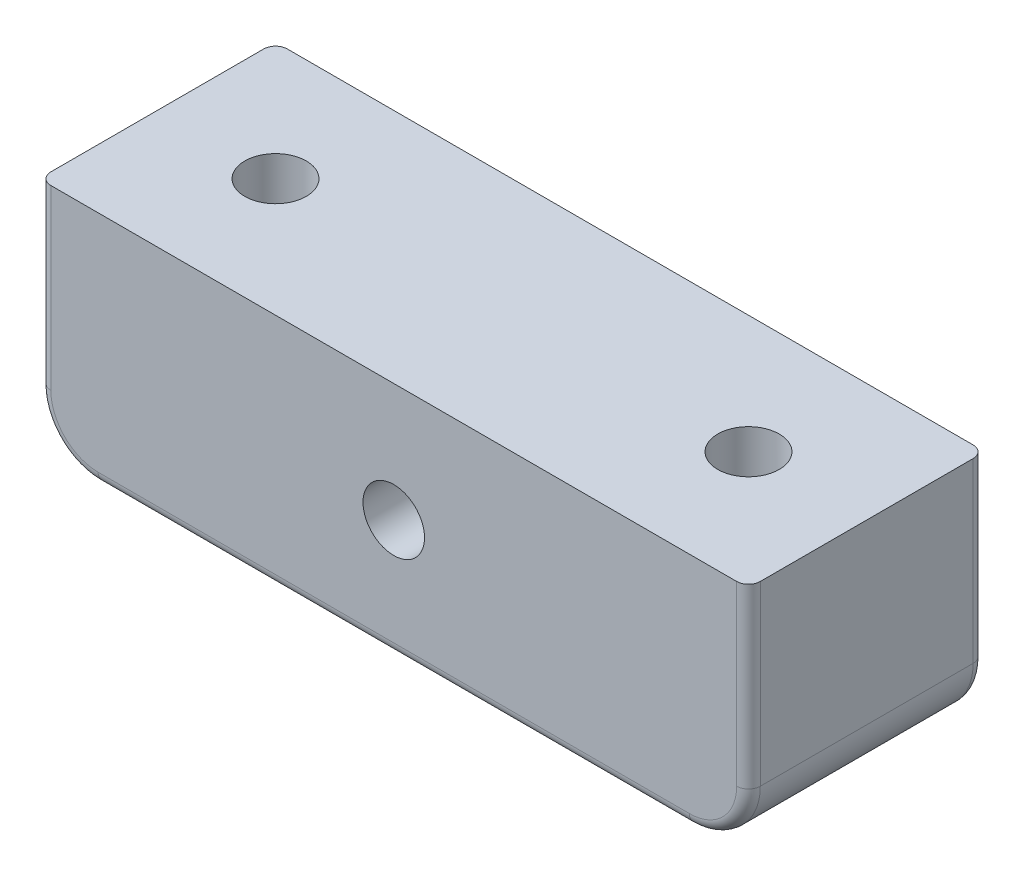
ISO-10303-21;
HEADER;
FILE_DESCRIPTION(('STEP AP214'),'2;1');
FILE_NAME('part.step','',(''),(''),'','','');
FILE_SCHEMA(('AUTOMOTIVE_DESIGN { 1 0 10303 214 1 1 1 1 }'));
ENDSEC;
DATA;
#1=APPLICATION_CONTEXT('core data for automotive mechanical design processes');
#2=APPLICATION_PROTOCOL_DEFINITION('international standard','automotive_design',2000,#1);
#3=PRODUCT_CONTEXT('',#1,'mechanical');
#4=PRODUCT('Part','Part','',(#3));
#5=PRODUCT_RELATED_PRODUCT_CATEGORY('part','',(#4));
#6=PRODUCT_DEFINITION_FORMATION('','',#4);
#7=PRODUCT_DEFINITION_CONTEXT('part definition',#1,'design');
#8=PRODUCT_DEFINITION('design','',#6,#7);
#9=PRODUCT_DEFINITION_SHAPE('','',#8);
#10=(LENGTH_UNIT() NAMED_UNIT(*) SI_UNIT(.MILLI.,.METRE.));
#11=(NAMED_UNIT(*) PLANE_ANGLE_UNIT() SI_UNIT($,.RADIAN.));
#12=(NAMED_UNIT(*) SI_UNIT($,.STERADIAN.) SOLID_ANGLE_UNIT());
#13=UNCERTAINTY_MEASURE_WITH_UNIT(LENGTH_MEASURE(1.E-05),#10,'distance_accuracy_value','');
#14=(GEOMETRIC_REPRESENTATION_CONTEXT(3) GLOBAL_UNCERTAINTY_ASSIGNED_CONTEXT((#13)) GLOBAL_UNIT_ASSIGNED_CONTEXT((#10,
#11,#12)) REPRESENTATION_CONTEXT('',''));
#15=CARTESIAN_POINT('',(0.,0.,0.));
#16=DIRECTION('',(0.,0.,1.));
#17=DIRECTION('',(1.,0.,0.));
#18=AXIS2_PLACEMENT_3D('',#15,#16,#17);
#19=CARTESIAN_POINT('',(0.,-10.,20.));
#20=DIRECTION('',(0.,0.,-1.));
#21=DIRECTION('',(-1.,0.,0.));
#22=AXIS2_PLACEMENT_3D('',#19,#20,#21);
#23=CYLINDRICAL_SURFACE('',#22,2.6);
#24=CARTESIAN_POINT('',(0.,-10.,20.));
#25=DIRECTION('',(0.,0.,1.));
#26=DIRECTION('',(1.,0.,0.));
#27=AXIS2_PLACEMENT_3D('',#24,#25,#26);
#28=CIRCLE('',#27,2.6);
#29=CARTESIAN_POINT('',(2.6,-10.,20.));
#30=VERTEX_POINT('',#29);
#31=EDGE_CURVE('E233',#30,#30,#28,.T.);
#32=ORIENTED_EDGE('',*,*,#31,.T.);
#33=EDGE_LOOP('',(#32));
#34=FACE_BOUND('',#33,.T.);
#35=CARTESIAN_POINT('',(0.,-10.,3.));
#36=DIRECTION('',(0.,0.,-1.));
#37=DIRECTION('',(-1.,0.,0.));
#38=AXIS2_PLACEMENT_3D('',#35,#36,#37);
#39=CIRCLE('',#38,2.6);
#40=CARTESIAN_POINT('',(-2.6,-10.,3.));
#41=VERTEX_POINT('',#40);
#42=EDGE_CURVE('E213',#41,#41,#39,.T.);
#43=ORIENTED_EDGE('',*,*,#42,.T.);
#44=EDGE_LOOP('',(#43));
#45=FACE_BOUND('',#44,.T.);
#46=ADVANCED_FACE('F33',(#34,#45),#23,.F.);
#47=CARTESIAN_POINT('',(-25.,-15.,20.));
#48=DIRECTION('',(0.,0.,-1.));
#49=DIRECTION('',(-1.,0.,0.));
#50=AXIS2_PLACEMENT_3D('',#47,#48,#49);
#51=PLANE('',#50);
#52=DIRECTION('',(-1.,0.,0.));
#53=VECTOR('',#52,1.);
#54=CARTESIAN_POINT('',(-30.,0.,20.));
#55=LINE('',#54,#53);
#56=CARTESIAN_POINT('',(29.,0.,20.));
#57=VERTEX_POINT('',#56);
#58=CARTESIAN_POINT('',(-29.,0.,20.));
#59=VERTEX_POINT('',#58);
#60=EDGE_CURVE('E237',#57,#59,#55,.T.);
#61=ORIENTED_EDGE('',*,*,#60,.T.);
#62=DIRECTION('',(0.,-1.,0.));
#63=VECTOR('',#62,1.);
#64=CARTESIAN_POINT('',(-29.,-15.,20.));
#65=LINE('',#64,#63);
#66=CARTESIAN_POINT('',(-29.,-15.,20.));
#67=VERTEX_POINT('',#66);
#68=EDGE_CURVE('E304',#59,#67,#65,.T.);
#69=ORIENTED_EDGE('',*,*,#68,.T.);
#70=CARTESIAN_POINT('',(-25.,-15.,20.));
#71=DIRECTION('',(0.,0.,-1.));
#72=DIRECTION('',(-1.,0.,0.));
#73=AXIS2_PLACEMENT_3D('',#70,#71,#72);
#74=CIRCLE('',#73,4.);
#75=CARTESIAN_POINT('',(-25.,-19.,20.));
#76=VERTEX_POINT('',#75);
#77=EDGE_CURVE('E57',#67,#76,#74,.F.);
#78=ORIENTED_EDGE('',*,*,#77,.T.);
#79=DIRECTION('',(1.,0.,0.));
#80=VECTOR('',#79,1.);
#81=CARTESIAN_POINT('',(-25.,-19.,20.));
#82=LINE('',#81,#80);
#83=CARTESIAN_POINT('',(25.,-19.,20.));
#84=VERTEX_POINT('',#83);
#85=EDGE_CURVE('E301',#76,#84,#82,.T.);
#86=ORIENTED_EDGE('',*,*,#85,.T.);
#87=CARTESIAN_POINT('',(25.,-15.,20.));
#88=DIRECTION('',(0.,0.,-1.));
#89=DIRECTION('',(-1.,0.,0.));
#90=AXIS2_PLACEMENT_3D('',#87,#88,#89);
#91=CIRCLE('',#90,4.);
#92=CARTESIAN_POINT('',(29.,-15.,20.));
#93=VERTEX_POINT('',#92);
#94=EDGE_CURVE('E297',#84,#93,#91,.F.);
#95=ORIENTED_EDGE('',*,*,#94,.T.);
#96=DIRECTION('',(0.,1.,0.));
#97=VECTOR('',#96,1.);
#98=CARTESIAN_POINT('',(29.,-15.,20.));
#99=LINE('',#98,#97);
#100=EDGE_CURVE('E299',#93,#57,#99,.T.);
#101=ORIENTED_EDGE('',*,*,#100,.T.);
#102=EDGE_LOOP('',(#61,#69,#78,#86,#95,#101));
#103=FACE_BOUND('',#102,.T.);
#104=ORIENTED_EDGE('',*,*,#31,.F.);
#105=EDGE_LOOP('',(#104));
#106=FACE_BOUND('',#105,.T.);
#107=ADVANCED_FACE('F336',(#103,#106),#51,.F.);
#108=CARTESIAN_POINT('',(-25.,-15.,0.));
#109=DIRECTION('',(0.,0.,-1.));
#110=DIRECTION('',(-1.,0.,0.));
#111=AXIS2_PLACEMENT_3D('',#108,#109,#110);
#112=PLANE('',#111);
#113=DIRECTION('',(-0.866025403784439,-0.5,0.));
#114=VECTOR('',#113,1.);
#115=CARTESIAN_POINT('',(6.5,-13.7527767497326,0.));
#116=LINE('',#115,#114);
#117=CARTESIAN_POINT('',(6.5,-13.7527767497326,0.));
#118=VERTEX_POINT('',#117);
#119=CARTESIAN_POINT('',(0.,-17.5055534994651,0.));
#120=VERTEX_POINT('',#119);
#121=EDGE_CURVE('E168',#118,#120,#116,.T.);
#122=ORIENTED_EDGE('',*,*,#121,.F.);
#123=DIRECTION('',(0.,-1.,0.));
#124=VECTOR('',#123,1.);
#125=CARTESIAN_POINT('',(6.5,-6.24722325026744,0.));
#126=LINE('',#125,#124);
#127=CARTESIAN_POINT('',(6.5,-6.24722325026744,0.));
#128=VERTEX_POINT('',#127);
#129=EDGE_CURVE('E186',#128,#118,#126,.T.);
#130=ORIENTED_EDGE('',*,*,#129,.F.);
#131=DIRECTION('',(0.866025403784438,-0.5,0.));
#132=VECTOR('',#131,1.);
#133=CARTESIAN_POINT('',(0.,-2.49444650053486,0.));
#134=LINE('',#133,#132);
#135=CARTESIAN_POINT('',(0.,-2.49444650053486,0.));
#136=VERTEX_POINT('',#135);
#137=EDGE_CURVE('E189',#136,#128,#134,.T.);
#138=ORIENTED_EDGE('',*,*,#137,.F.);
#139=DIRECTION('',(0.866025403784439,0.5,0.));
#140=VECTOR('',#139,1.);
#141=CARTESIAN_POINT('',(-6.5,-6.24722325026742,0.));
#142=LINE('',#141,#140);
#143=CARTESIAN_POINT('',(-6.5,-6.24722325026742,0.));
#144=VERTEX_POINT('',#143);
#145=EDGE_CURVE('E206',#144,#136,#142,.T.);
#146=ORIENTED_EDGE('',*,*,#145,.F.);
#147=DIRECTION('',(0.,1.,0.));
#148=VECTOR('',#147,1.);
#149=CARTESIAN_POINT('',(-6.5,-13.7527767497326,0.));
#150=LINE('',#149,#148);
#151=CARTESIAN_POINT('',(-6.5,-13.7527767497326,0.));
#152=VERTEX_POINT('',#151);
#153=EDGE_CURVE('E203',#152,#144,#150,.T.);
#154=ORIENTED_EDGE('',*,*,#153,.F.);
#155=DIRECTION('',(-0.866025403784439,0.5,0.));
#156=VECTOR('',#155,1.);
#157=CARTESIAN_POINT('',(0.,-17.5055534994651,0.));
#158=LINE('',#157,#156);
#159=EDGE_CURVE('E200',#120,#152,#158,.T.);
#160=ORIENTED_EDGE('',*,*,#159,.F.);
#161=EDGE_LOOP('',(#122,#130,#138,#146,#154,#160));
#162=FACE_BOUND('',#161,.T.);
#163=CARTESIAN_POINT('',(-25.,-15.,0.));
#164=DIRECTION('',(0.,0.,-1.));
#165=DIRECTION('',(-1.,0.,0.));
#166=AXIS2_PLACEMENT_3D('',#163,#164,#165);
#167=CIRCLE('',#166,4.);
#168=CARTESIAN_POINT('',(-25.,-19.,0.));
#169=VERTEX_POINT('',#168);
#170=CARTESIAN_POINT('',(-29.,-15.,0.));
#171=VERTEX_POINT('',#170);
#172=EDGE_CURVE('E273',#169,#171,#167,.T.);
#173=ORIENTED_EDGE('',*,*,#172,.T.);
#174=DIRECTION('',(0.,-1.,0.));
#175=VECTOR('',#174,1.);
#176=CARTESIAN_POINT('',(-29.,0.,0.));
#177=LINE('',#176,#175);
#178=CARTESIAN_POINT('',(-29.,0.,0.));
#179=VERTEX_POINT('',#178);
#180=EDGE_CURVE('E275',#171,#179,#177,.F.);
#181=ORIENTED_EDGE('',*,*,#180,.T.);
#182=DIRECTION('',(-1.,0.,0.));
#183=VECTOR('',#182,1.);
#184=CARTESIAN_POINT('',(-30.,0.,0.));
#185=LINE('',#184,#183);
#186=CARTESIAN_POINT('',(29.,0.,0.));
#187=VERTEX_POINT('',#186);
#188=EDGE_CURVE('E236',#187,#179,#185,.T.);
#189=ORIENTED_EDGE('',*,*,#188,.F.);
#190=DIRECTION('',(0.,1.,0.));
#191=VECTOR('',#190,1.);
#192=CARTESIAN_POINT('',(29.,-15.,0.));
#193=LINE('',#192,#191);
#194=CARTESIAN_POINT('',(29.,-15.,0.));
#195=VERTEX_POINT('',#194);
#196=EDGE_CURVE('E269',#187,#195,#193,.F.);
#197=ORIENTED_EDGE('',*,*,#196,.T.);
#198=CARTESIAN_POINT('',(25.,-15.,0.));
#199=DIRECTION('',(0.,0.,-1.));
#200=DIRECTION('',(-1.,0.,0.));
#201=AXIS2_PLACEMENT_3D('',#198,#199,#200);
#202=CIRCLE('',#201,4.);
#203=CARTESIAN_POINT('',(25.,-19.,0.));
#204=VERTEX_POINT('',#203);
#205=EDGE_CURVE('E267',#195,#204,#202,.T.);
#206=ORIENTED_EDGE('',*,*,#205,.T.);
#207=DIRECTION('',(1.,0.,0.));
#208=VECTOR('',#207,1.);
#209=CARTESIAN_POINT('',(-25.,-19.,0.));
#210=LINE('',#209,#208);
#211=EDGE_CURVE('E271',#204,#169,#210,.F.);
#212=ORIENTED_EDGE('',*,*,#211,.T.);
#213=EDGE_LOOP('',(#173,#181,#189,#197,#206,#212));
#214=FACE_BOUND('',#213,.T.);
#215=ADVANCED_FACE('F372',(#162,#214),#112,.T.);
#216=CARTESIAN_POINT('',(-30.,0.,20.));
#217=DIRECTION('',(1.,0.,0.));
#218=DIRECTION('',(0.,1.,0.));
#219=AXIS2_PLACEMENT_3D('',#216,#217,#218);
#220=PLANE('',#219);
#221=DIRECTION('',(0.,0.,-1.));
#222=VECTOR('',#221,1.);
#223=CARTESIAN_POINT('',(-30.,0.,20.));
#224=LINE('',#223,#222);
#225=CARTESIAN_POINT('',(-30.,0.,19.));
#226=VERTEX_POINT('',#225);
#227=CARTESIAN_POINT('',(-30.,0.,1.));
#228=VERTEX_POINT('',#227);
#229=EDGE_CURVE('E240',#226,#228,#224,.T.);
#230=ORIENTED_EDGE('',*,*,#229,.T.);
#231=DIRECTION('',(0.,-1.,0.));
#232=VECTOR('',#231,1.);
#233=CARTESIAN_POINT('',(-30.,-15.,1.));
#234=LINE('',#233,#232);
#235=CARTESIAN_POINT('',(-30.,-15.,1.));
#236=VERTEX_POINT('',#235);
#237=EDGE_CURVE('E264',#228,#236,#234,.T.);
#238=ORIENTED_EDGE('',*,*,#237,.T.);
#239=DIRECTION('',(0.,0.,-1.));
#240=VECTOR('',#239,1.);
#241=CARTESIAN_POINT('',(-30.,-15.,20.));
#242=LINE('',#241,#240);
#243=CARTESIAN_POINT('',(-30.,-15.,19.));
#244=VERTEX_POINT('',#243);
#245=EDGE_CURVE('E257',#244,#236,#242,.T.);
#246=ORIENTED_EDGE('',*,*,#245,.F.);
#247=DIRECTION('',(0.,-1.,0.));
#248=VECTOR('',#247,1.);
#249=CARTESIAN_POINT('',(-30.,0.,19.));
#250=LINE('',#249,#248);
#251=EDGE_CURVE('E260',#244,#226,#250,.F.);
#252=ORIENTED_EDGE('',*,*,#251,.T.);
#253=EDGE_LOOP('',(#230,#238,#246,#252));
#254=FACE_BOUND('',#253,.T.);
#255=ADVANCED_FACE('F365',(#254),#220,.F.);
#256=CARTESIAN_POINT('',(-25.,-15.,20.));
#257=DIRECTION('',(0.,0.,-1.));
#258=DIRECTION('',(-1.,0.,0.));
#259=AXIS2_PLACEMENT_3D('',#256,#257,#258);
#260=CYLINDRICAL_SURFACE('',#259,5.);
#261=ORIENTED_EDGE('',*,*,#245,.T.);
#262=CARTESIAN_POINT('',(-25.,-15.,1.));
#263=DIRECTION('',(0.,0.,-1.));
#264=DIRECTION('',(-1.,0.,0.));
#265=AXIS2_PLACEMENT_3D('',#262,#263,#264);
#266=CIRCLE('',#265,5.);
#267=CARTESIAN_POINT('',(-25.,-20.,1.));
#268=VERTEX_POINT('',#267);
#269=EDGE_CURVE('E287',#236,#268,#266,.F.);
#270=ORIENTED_EDGE('',*,*,#269,.T.);
#271=DIRECTION('',(0.,0.,-1.));
#272=VECTOR('',#271,1.);
#273=CARTESIAN_POINT('',(-25.,-20.,20.));
#274=LINE('',#273,#272);
#275=CARTESIAN_POINT('',(-25.,-20.,19.));
#276=VERTEX_POINT('',#275);
#277=EDGE_CURVE('E254',#276,#268,#274,.T.);
#278=ORIENTED_EDGE('',*,*,#277,.F.);
#279=CARTESIAN_POINT('',(-25.,-15.,19.));
#280=DIRECTION('',(0.,0.,-1.));
#281=DIRECTION('',(-1.,0.,0.));
#282=AXIS2_PLACEMENT_3D('',#279,#280,#281);
#283=CIRCLE('',#282,5.);
#284=EDGE_CURVE('E285',#276,#244,#283,.T.);
#285=ORIENTED_EDGE('',*,*,#284,.T.);
#286=EDGE_LOOP('',(#261,#270,#278,#285));
#287=FACE_BOUND('',#286,.T.);
#288=ADVANCED_FACE('F357',(#287),#260,.T.);
#289=CARTESIAN_POINT('',(-25.,-20.,20.));
#290=DIRECTION('',(0.,1.,0.));
#291=DIRECTION('',(-1.,0.,0.));
#292=AXIS2_PLACEMENT_3D('',#289,#290,#291);
#293=PLANE('',#292);
#294=CARTESIAN_POINT('',(20.,-20.,10.));
#295=DIRECTION('',(0.,1.,0.));
#296=DIRECTION('',(-1.,0.,0.));
#297=AXIS2_PLACEMENT_3D('',#294,#295,#296);
#298=CIRCLE('',#297,2.6);
#299=CARTESIAN_POINT('',(17.4,-20.,10.));
#300=VERTEX_POINT('',#299);
#301=EDGE_CURVE('E224',#300,#300,#298,.F.);
#302=ORIENTED_EDGE('',*,*,#301,.F.);
#303=EDGE_LOOP('',(#302));
#304=FACE_BOUND('',#303,.T.);
#305=CARTESIAN_POINT('',(-20.,-20.,10.));
#306=DIRECTION('',(0.,1.,0.));
#307=DIRECTION('',(-1.,0.,0.));
#308=AXIS2_PLACEMENT_3D('',#305,#306,#307);
#309=CIRCLE('',#308,2.6);
#310=CARTESIAN_POINT('',(-22.6,-20.,10.));
#311=VERTEX_POINT('',#310);
#312=EDGE_CURVE('E230',#311,#311,#309,.F.);
#313=ORIENTED_EDGE('',*,*,#312,.F.);
#314=EDGE_LOOP('',(#313));
#315=FACE_BOUND('',#314,.T.);
#316=ORIENTED_EDGE('',*,*,#277,.T.);
#317=DIRECTION('',(1.,0.,0.));
#318=VECTOR('',#317,1.);
#319=CARTESIAN_POINT('',(25.,-20.,1.));
#320=LINE('',#319,#318);
#321=CARTESIAN_POINT('',(25.,-20.,1.));
#322=VERTEX_POINT('',#321);
#323=EDGE_CURVE('E291',#268,#322,#320,.T.);
#324=ORIENTED_EDGE('',*,*,#323,.T.);
#325=DIRECTION('',(0.,0.,-1.));
#326=VECTOR('',#325,1.);
#327=CARTESIAN_POINT('',(25.,-20.,20.));
#328=LINE('',#327,#326);
#329=CARTESIAN_POINT('',(25.,-20.,19.));
#330=VERTEX_POINT('',#329);
#331=EDGE_CURVE('E251',#330,#322,#328,.T.);
#332=ORIENTED_EDGE('',*,*,#331,.F.);
#333=DIRECTION('',(1.,0.,0.));
#334=VECTOR('',#333,1.);
#335=CARTESIAN_POINT('',(-25.,-20.,19.));
#336=LINE('',#335,#334);
#337=EDGE_CURVE('E289',#330,#276,#336,.F.);
#338=ORIENTED_EDGE('',*,*,#337,.T.);
#339=EDGE_LOOP('',(#316,#324,#332,#338));
#340=FACE_BOUND('',#339,.T.);
#341=ADVANCED_FACE('F354',(#304,#315,#340),#293,.F.);
#342=CARTESIAN_POINT('',(25.,-15.,20.));
#343=DIRECTION('',(0.,0.,-1.));
#344=DIRECTION('',(-1.,0.,0.));
#345=AXIS2_PLACEMENT_3D('',#342,#343,#344);
#346=CYLINDRICAL_SURFACE('',#345,5.);
#347=ORIENTED_EDGE('',*,*,#331,.T.);
#348=CARTESIAN_POINT('',(25.,-15.,1.));
#349=DIRECTION('',(0.,0.,-1.));
#350=DIRECTION('',(-1.,0.,0.));
#351=AXIS2_PLACEMENT_3D('',#348,#349,#350);
#352=CIRCLE('',#351,5.);
#353=CARTESIAN_POINT('',(30.,-15.,1.));
#354=VERTEX_POINT('',#353);
#355=EDGE_CURVE('E11',#322,#354,#352,.F.);
#356=ORIENTED_EDGE('',*,*,#355,.T.);
#357=DIRECTION('',(0.,0.,-1.));
#358=VECTOR('',#357,1.);
#359=CARTESIAN_POINT('',(30.,-15.,20.));
#360=LINE('',#359,#358);
#361=CARTESIAN_POINT('',(30.,-15.,19.));
#362=VERTEX_POINT('',#361);
#363=EDGE_CURVE('E248',#362,#354,#360,.T.);
#364=ORIENTED_EDGE('',*,*,#363,.F.);
#365=CARTESIAN_POINT('',(25.,-15.,19.));
#366=DIRECTION('',(0.,0.,-1.));
#367=DIRECTION('',(-1.,0.,0.));
#368=AXIS2_PLACEMENT_3D('',#365,#366,#367);
#369=CIRCLE('',#368,5.);
#370=EDGE_CURVE('E42',#362,#330,#369,.T.);
#371=ORIENTED_EDGE('',*,*,#370,.T.);
#372=EDGE_LOOP('',(#347,#356,#364,#371));
#373=FACE_BOUND('',#372,.T.);
#374=ADVANCED_FACE('F388',(#373),#346,.T.);
#375=CARTESIAN_POINT('',(30.,0.,20.));
#376=DIRECTION('',(-1.,0.,0.));
#377=DIRECTION('',(0.,-1.,0.));
#378=AXIS2_PLACEMENT_3D('',#375,#376,#377);
#379=PLANE('',#378);
#380=ORIENTED_EDGE('',*,*,#363,.T.);
#381=DIRECTION('',(0.,1.,0.));
#382=VECTOR('',#381,1.);
#383=CARTESIAN_POINT('',(30.,0.,1.));
#384=LINE('',#383,#382);
#385=CARTESIAN_POINT('',(30.,0.,1.));
#386=VERTEX_POINT('',#385);
#387=EDGE_CURVE('E295',#354,#386,#384,.T.);
#388=ORIENTED_EDGE('',*,*,#387,.T.);
#389=DIRECTION('',(0.,0.,-1.));
#390=VECTOR('',#389,1.);
#391=CARTESIAN_POINT('',(30.,0.,20.));
#392=LINE('',#391,#390);
#393=CARTESIAN_POINT('',(30.,0.,19.));
#394=VERTEX_POINT('',#393);
#395=EDGE_CURVE('E245',#394,#386,#392,.T.);
#396=ORIENTED_EDGE('',*,*,#395,.F.);
#397=DIRECTION('',(0.,1.,0.));
#398=VECTOR('',#397,1.);
#399=CARTESIAN_POINT('',(30.,0.,19.));
#400=LINE('',#399,#398);
#401=EDGE_CURVE('E293',#394,#362,#400,.F.);
#402=ORIENTED_EDGE('',*,*,#401,.T.);
#403=EDGE_LOOP('',(#380,#388,#396,#402));
#404=FACE_BOUND('',#403,.T.);
#405=ADVANCED_FACE('F391',(#404),#379,.F.);
#406=CARTESIAN_POINT('',(-30.,0.,20.));
#407=DIRECTION('',(0.,-1.,0.));
#408=DIRECTION('',(1.,0.,0.));
#409=AXIS2_PLACEMENT_3D('',#406,#407,#408);
#410=PLANE('',#409);
#411=CARTESIAN_POINT('',(20.,0.,10.));
#412=DIRECTION('',(0.,1.,0.));
#413=DIRECTION('',(1.,0.,0.));
#414=AXIS2_PLACEMENT_3D('',#411,#412,#413);
#415=CIRCLE('',#414,2.6);
#416=CARTESIAN_POINT('',(22.6,0.,10.));
#417=VERTEX_POINT('',#416);
#418=EDGE_CURVE('E221',#417,#417,#415,.T.);
#419=ORIENTED_EDGE('',*,*,#418,.F.);
#420=EDGE_LOOP('',(#419));
#421=FACE_BOUND('',#420,.T.);
#422=CARTESIAN_POINT('',(-20.,0.,10.));
#423=DIRECTION('',(0.,1.,0.));
#424=DIRECTION('',(-1.,0.,0.));
#425=AXIS2_PLACEMENT_3D('',#422,#423,#424);
#426=CIRCLE('',#425,2.6);
#427=CARTESIAN_POINT('',(-22.6,0.,10.));
#428=VERTEX_POINT('',#427);
#429=EDGE_CURVE('E227',#428,#428,#426,.T.);
#430=ORIENTED_EDGE('',*,*,#429,.F.);
#431=EDGE_LOOP('',(#430));
#432=FACE_BOUND('',#431,.T.);
#433=ORIENTED_EDGE('',*,*,#188,.T.);
#434=CARTESIAN_POINT('',(-29.,0.,1.));
#435=DIRECTION('',(0.,-1.,0.));
#436=DIRECTION('',(1.,0.,0.));
#437=AXIS2_PLACEMENT_3D('',#434,#435,#436);
#438=CIRCLE('',#437,1.);
#439=EDGE_CURVE('E283',#179,#228,#438,.F.);
#440=ORIENTED_EDGE('',*,*,#439,.T.);
#441=ORIENTED_EDGE('',*,*,#229,.F.);
#442=CARTESIAN_POINT('',(-29.,0.,19.));
#443=DIRECTION('',(0.,-1.,0.));
#444=DIRECTION('',(1.,0.,0.));
#445=AXIS2_PLACEMENT_3D('',#442,#443,#444);
#446=CIRCLE('',#445,1.);
#447=EDGE_CURVE('E279',#226,#59,#446,.F.);
#448=ORIENTED_EDGE('',*,*,#447,.T.);
#449=ORIENTED_EDGE('',*,*,#60,.F.);
#450=CARTESIAN_POINT('',(29.,0.,19.));
#451=DIRECTION('',(0.,-1.,0.));
#452=DIRECTION('',(1.,0.,0.));
#453=AXIS2_PLACEMENT_3D('',#450,#451,#452);
#454=CIRCLE('',#453,1.);
#455=EDGE_CURVE('E277',#57,#394,#454,.F.);
#456=ORIENTED_EDGE('',*,*,#455,.T.);
#457=ORIENTED_EDGE('',*,*,#395,.T.);
#458=CARTESIAN_POINT('',(29.,0.,1.));
#459=DIRECTION('',(0.,-1.,0.));
#460=DIRECTION('',(1.,0.,0.));
#461=AXIS2_PLACEMENT_3D('',#458,#459,#460);
#462=CIRCLE('',#461,1.);
#463=EDGE_CURVE('E281',#386,#187,#462,.F.);
#464=ORIENTED_EDGE('',*,*,#463,.T.);
#465=EDGE_LOOP('',(#433,#440,#441,#448,#449,#456,#457,#464));
#466=FACE_BOUND('',#465,.T.);
#467=ADVANCED_FACE('F339',(#421,#432,#466),#410,.F.);
#468=CARTESIAN_POINT('',(-20.,-27.3539105243401,10.));
#469=DIRECTION('',(0.,1.,0.));
#470=DIRECTION('',(-1.,0.,0.));
#471=AXIS2_PLACEMENT_3D('',#468,#469,#470);
#472=CYLINDRICAL_SURFACE('',#471,2.6);
#473=ORIENTED_EDGE('',*,*,#312,.T.);
#474=EDGE_LOOP('',(#473));
#475=FACE_BOUND('',#474,.T.);
#476=ORIENTED_EDGE('',*,*,#429,.T.);
#477=EDGE_LOOP('',(#476));
#478=FACE_BOUND('',#477,.T.);
#479=ADVANCED_FACE('F398',(#475,#478),#472,.F.);
#480=CARTESIAN_POINT('',(20.,-27.3539105243401,10.));
#481=DIRECTION('',(0.,1.,0.));
#482=DIRECTION('',(-1.,0.,0.));
#483=AXIS2_PLACEMENT_3D('',#480,#481,#482);
#484=CYLINDRICAL_SURFACE('',#483,2.6);
#485=ORIENTED_EDGE('',*,*,#301,.T.);
#486=EDGE_LOOP('',(#485));
#487=FACE_BOUND('',#486,.T.);
#488=ORIENTED_EDGE('',*,*,#418,.T.);
#489=EDGE_LOOP('',(#488));
#490=FACE_BOUND('',#489,.T.);
#491=ADVANCED_FACE('F440',(#487,#490),#484,.F.);
#492=CARTESIAN_POINT('',(6.5,-13.7527767497326,3.));
#493=DIRECTION('',(0.5,-0.866025403784439,0.));
#494=DIRECTION('',(0.866025403784439,0.5,0.));
#495=AXIS2_PLACEMENT_3D('',#492,#493,#494);
#496=PLANE('',#495);
#497=ORIENTED_EDGE('',*,*,#121,.T.);
#498=DIRECTION('',(0.,0.,-1.));
#499=VECTOR('',#498,1.);
#500=CARTESIAN_POINT('',(0.,-17.5055534994651,3.));
#501=LINE('',#500,#499);
#502=CARTESIAN_POINT('',(0.,-17.5055534994651,3.));
#503=VERTEX_POINT('',#502);
#504=EDGE_CURVE('E161',#503,#120,#501,.T.);
#505=ORIENTED_EDGE('',*,*,#504,.F.);
#506=DIRECTION('',(-0.866025403784439,-0.5,0.));
#507=VECTOR('',#506,1.);
#508=CARTESIAN_POINT('',(6.5,-13.7527767497326,3.));
#509=LINE('',#508,#507);
#510=CARTESIAN_POINT('',(6.5,-13.7527767497326,3.));
#511=VERTEX_POINT('',#510);
#512=EDGE_CURVE('E165',#511,#503,#509,.T.);
#513=ORIENTED_EDGE('',*,*,#512,.F.);
#514=DIRECTION('',(0.,0.,-1.));
#515=VECTOR('',#514,1.);
#516=CARTESIAN_POINT('',(6.5,-13.7527767497326,3.));
#517=LINE('',#516,#515);
#518=EDGE_CURVE('E211',#511,#118,#517,.T.);
#519=ORIENTED_EDGE('',*,*,#518,.T.);
#520=EDGE_LOOP('',(#497,#505,#513,#519));
#521=FACE_BOUND('',#520,.T.);
#522=ADVANCED_FACE('F163',(#521),#496,.F.);
#523=CARTESIAN_POINT('',(6.5,-6.24722325026744,3.));
#524=DIRECTION('',(1.,0.,0.));
#525=DIRECTION('',(0.,1.,0.));
#526=AXIS2_PLACEMENT_3D('',#523,#524,#525);
#527=PLANE('',#526);
#528=ORIENTED_EDGE('',*,*,#129,.T.);
#529=ORIENTED_EDGE('',*,*,#518,.F.);
#530=DIRECTION('',(0.,-1.,0.));
#531=VECTOR('',#530,1.);
#532=CARTESIAN_POINT('',(6.5,-6.24722325026744,3.));
#533=LINE('',#532,#531);
#534=CARTESIAN_POINT('',(6.5,-6.24722325026744,3.));
#535=VERTEX_POINT('',#534);
#536=EDGE_CURVE('E173',#535,#511,#533,.T.);
#537=ORIENTED_EDGE('',*,*,#536,.F.);
#538=DIRECTION('',(0.,0.,-1.));
#539=VECTOR('',#538,1.);
#540=CARTESIAN_POINT('',(6.5,-6.24722325026744,3.));
#541=LINE('',#540,#539);
#542=EDGE_CURVE('E214',#535,#128,#541,.T.);
#543=ORIENTED_EDGE('',*,*,#542,.T.);
#544=EDGE_LOOP('',(#528,#529,#537,#543));
#545=FACE_BOUND('',#544,.T.);
#546=ADVANCED_FACE('F432',(#545),#527,.F.);
#547=CARTESIAN_POINT('',(0.,-2.49444650053486,3.));
#548=DIRECTION('',(0.5,0.866025403784438,0.));
#549=DIRECTION('',(-0.866025403784438,0.5,0.));
#550=AXIS2_PLACEMENT_3D('',#547,#548,#549);
#551=PLANE('',#550);
#552=ORIENTED_EDGE('',*,*,#137,.T.);
#553=ORIENTED_EDGE('',*,*,#542,.F.);
#554=DIRECTION('',(0.866025403784438,-0.5,0.));
#555=VECTOR('',#554,1.);
#556=CARTESIAN_POINT('',(0.,-2.49444650053486,3.));
#557=LINE('',#556,#555);
#558=CARTESIAN_POINT('',(0.,-2.49444650053486,3.));
#559=VERTEX_POINT('',#558);
#560=EDGE_CURVE('E196',#559,#535,#557,.T.);
#561=ORIENTED_EDGE('',*,*,#560,.F.);
#562=DIRECTION('',(0.,0.,-1.));
#563=VECTOR('',#562,1.);
#564=CARTESIAN_POINT('',(0.,-2.49444650053486,3.));
#565=LINE('',#564,#563);
#566=EDGE_CURVE('E216',#559,#136,#565,.T.);
#567=ORIENTED_EDGE('',*,*,#566,.T.);
#568=EDGE_LOOP('',(#552,#553,#561,#567));
#569=FACE_BOUND('',#568,.T.);
#570=ADVANCED_FACE('F430',(#569),#551,.F.);
#571=CARTESIAN_POINT('',(-6.5,-6.24722325026742,3.));
#572=DIRECTION('',(-0.5,0.866025403784439,0.));
#573=DIRECTION('',(-0.866025403784439,-0.5,0.));
#574=AXIS2_PLACEMENT_3D('',#571,#572,#573);
#575=PLANE('',#574);
#576=ORIENTED_EDGE('',*,*,#145,.T.);
#577=ORIENTED_EDGE('',*,*,#566,.F.);
#578=DIRECTION('',(0.866025403784439,0.5,0.));
#579=VECTOR('',#578,1.);
#580=CARTESIAN_POINT('',(-6.5,-6.24722325026742,3.));
#581=LINE('',#580,#579);
#582=CARTESIAN_POINT('',(-6.5,-6.24722325026742,3.));
#583=VERTEX_POINT('',#582);
#584=EDGE_CURVE('E193',#583,#559,#581,.T.);
#585=ORIENTED_EDGE('',*,*,#584,.F.);
#586=DIRECTION('',(0.,0.,-1.));
#587=VECTOR('',#586,1.);
#588=CARTESIAN_POINT('',(-6.5,-6.24722325026742,3.));
#589=LINE('',#588,#587);
#590=EDGE_CURVE('E218',#583,#144,#589,.T.);
#591=ORIENTED_EDGE('',*,*,#590,.T.);
#592=EDGE_LOOP('',(#576,#577,#585,#591));
#593=FACE_BOUND('',#592,.T.);
#594=ADVANCED_FACE('F428',(#593),#575,.F.);
#595=CARTESIAN_POINT('',(-6.5,-13.7527767497326,3.));
#596=DIRECTION('',(-1.,0.,0.));
#597=DIRECTION('',(0.,0.,1.));
#598=AXIS2_PLACEMENT_3D('',#595,#596,#597);
#599=PLANE('',#598);
#600=ORIENTED_EDGE('',*,*,#153,.T.);
#601=ORIENTED_EDGE('',*,*,#590,.F.);
#602=DIRECTION('',(0.,1.,0.));
#603=VECTOR('',#602,1.);
#604=CARTESIAN_POINT('',(-6.5,-13.7527767497326,3.));
#605=LINE('',#604,#603);
#606=CARTESIAN_POINT('',(-6.5,-13.7527767497326,3.));
#607=VERTEX_POINT('',#606);
#608=EDGE_CURVE('E181',#607,#583,#605,.T.);
#609=ORIENTED_EDGE('',*,*,#608,.F.);
#610=DIRECTION('',(0.,0.,-1.));
#611=VECTOR('',#610,1.);
#612=CARTESIAN_POINT('',(-6.5,-13.7527767497326,3.));
#613=LINE('',#612,#611);
#614=EDGE_CURVE('E172',#607,#152,#613,.T.);
#615=ORIENTED_EDGE('',*,*,#614,.T.);
#616=EDGE_LOOP('',(#600,#601,#609,#615));
#617=FACE_BOUND('',#616,.T.);
#618=ADVANCED_FACE('F424',(#617),#599,.F.);
#619=CARTESIAN_POINT('',(0.,-17.5055534994651,3.));
#620=DIRECTION('',(-0.5,-0.866025403784439,0.));
#621=DIRECTION('',(0.866025403784439,-0.5,0.));
#622=AXIS2_PLACEMENT_3D('',#619,#620,#621);
#623=PLANE('',#622);
#624=ORIENTED_EDGE('',*,*,#159,.T.);
#625=ORIENTED_EDGE('',*,*,#614,.F.);
#626=DIRECTION('',(-0.866025403784439,0.5,0.));
#627=VECTOR('',#626,1.);
#628=CARTESIAN_POINT('',(0.,-17.5055534994651,3.));
#629=LINE('',#628,#627);
#630=EDGE_CURVE('E176',#503,#607,#629,.T.);
#631=ORIENTED_EDGE('',*,*,#630,.F.);
#632=ORIENTED_EDGE('',*,*,#504,.T.);
#633=EDGE_LOOP('',(#624,#625,#631,#632));
#634=FACE_BOUND('',#633,.T.);
#635=ADVANCED_FACE('F177',(#634),#623,.F.);
#636=CARTESIAN_POINT('',(0.,0.,3.));
#637=DIRECTION('',(0.,0.,-1.));
#638=DIRECTION('',(-1.,0.,0.));
#639=AXIS2_PLACEMENT_3D('',#636,#637,#638);
#640=PLANE('',#639);
#641=ORIENTED_EDGE('',*,*,#42,.F.);
#642=EDGE_LOOP('',(#641));
#643=FACE_BOUND('',#642,.T.);
#644=ORIENTED_EDGE('',*,*,#512,.T.);
#645=ORIENTED_EDGE('',*,*,#630,.T.);
#646=ORIENTED_EDGE('',*,*,#608,.T.);
#647=ORIENTED_EDGE('',*,*,#584,.T.);
#648=ORIENTED_EDGE('',*,*,#560,.T.);
#649=ORIENTED_EDGE('',*,*,#536,.T.);
#650=EDGE_LOOP('',(#644,#645,#646,#647,#648,#649));
#651=FACE_BOUND('',#650,.T.);
#652=ADVANCED_FACE('F183',(#643,#651),#640,.T.);
#653=CARTESIAN_POINT('',(29.,0.,1.));
#654=DIRECTION('',(0.,-1.,0.));
#655=DIRECTION('',(1.,0.,0.));
#656=AXIS2_PLACEMENT_3D('',#653,#654,#655);
#657=CYLINDRICAL_SURFACE('',#656,1.);
#658=ORIENTED_EDGE('',*,*,#463,.F.);
#659=ORIENTED_EDGE('',*,*,#387,.F.);
#660=CARTESIAN_POINT('',(29.,-15.,1.));
#661=DIRECTION('',(0.,-1.,0.));
#662=DIRECTION('',(0.,0.,-1.));
#663=AXIS2_PLACEMENT_3D('',#660,#661,#662);
#664=CIRCLE('',#663,1.);
#665=EDGE_CURVE('E201',#195,#354,#664,.T.);
#666=ORIENTED_EDGE('',*,*,#665,.F.);
#667=ORIENTED_EDGE('',*,*,#196,.F.);
#668=EDGE_LOOP('',(#658,#659,#666,#667));
#669=FACE_BOUND('',#668,.T.);
#670=ADVANCED_FACE('F377',(#669),#657,.T.);
#671=CARTESIAN_POINT('',(25.,-15.,1.));
#672=DIRECTION('',(0.,0.,-1.));
#673=DIRECTION('',(-1.,0.,0.));
#674=AXIS2_PLACEMENT_3D('',#671,#672,#673);
#675=TOROIDAL_SURFACE('',#674,4.,1.);
#676=ORIENTED_EDGE('',*,*,#665,.T.);
#677=ORIENTED_EDGE('',*,*,#355,.F.);
#678=CARTESIAN_POINT('',(25.,-19.,1.));
#679=DIRECTION('',(-1.,0.,0.));
#680=DIRECTION('',(0.,0.,1.));
#681=AXIS2_PLACEMENT_3D('',#678,#679,#680);
#682=CIRCLE('',#681,1.);
#683=EDGE_CURVE('E312',#204,#322,#682,.T.);
#684=ORIENTED_EDGE('',*,*,#683,.F.);
#685=ORIENTED_EDGE('',*,*,#205,.F.);
#686=EDGE_LOOP('',(#676,#677,#684,#685));
#687=FACE_BOUND('',#686,.T.);
#688=ADVANCED_FACE('F384',(#687),#675,.T.);
#689=CARTESIAN_POINT('',(-25.,-19.,1.));
#690=DIRECTION('',(-1.,0.,0.));
#691=DIRECTION('',(0.,-1.,0.));
#692=AXIS2_PLACEMENT_3D('',#689,#690,#691);
#693=CYLINDRICAL_SURFACE('',#692,1.);
#694=ORIENTED_EDGE('',*,*,#683,.T.);
#695=ORIENTED_EDGE('',*,*,#323,.F.);
#696=CARTESIAN_POINT('',(-25.,-19.,1.));
#697=DIRECTION('',(-1.,0.,0.));
#698=DIRECTION('',(0.,-1.,0.));
#699=AXIS2_PLACEMENT_3D('',#696,#697,#698);
#700=CIRCLE('',#699,1.);
#701=EDGE_CURVE('E309',#169,#268,#700,.T.);
#702=ORIENTED_EDGE('',*,*,#701,.F.);
#703=ORIENTED_EDGE('',*,*,#211,.F.);
#704=EDGE_LOOP('',(#694,#695,#702,#703));
#705=FACE_BOUND('',#704,.T.);
#706=ADVANCED_FACE('F386',(#705),#693,.T.);
#707=CARTESIAN_POINT('',(-25.,-15.,1.));
#708=DIRECTION('',(0.,0.,-1.));
#709=DIRECTION('',(-1.,0.,0.));
#710=AXIS2_PLACEMENT_3D('',#707,#708,#709);
#711=TOROIDAL_SURFACE('',#710,4.,1.);
#712=ORIENTED_EDGE('',*,*,#701,.T.);
#713=ORIENTED_EDGE('',*,*,#269,.F.);
#714=CARTESIAN_POINT('',(-29.,-15.,1.));
#715=DIRECTION('',(0.,1.,0.));
#716=DIRECTION('',(0.,0.,1.));
#717=AXIS2_PLACEMENT_3D('',#714,#715,#716);
#718=CIRCLE('',#717,1.);
#719=EDGE_CURVE('E307',#171,#236,#718,.T.);
#720=ORIENTED_EDGE('',*,*,#719,.F.);
#721=ORIENTED_EDGE('',*,*,#172,.F.);
#722=EDGE_LOOP('',(#712,#713,#720,#721));
#723=FACE_BOUND('',#722,.T.);
#724=ADVANCED_FACE('F361',(#723),#711,.T.);
#725=CARTESIAN_POINT('',(-29.,0.,1.));
#726=DIRECTION('',(0.,1.,0.));
#727=DIRECTION('',(-1.,0.,0.));
#728=AXIS2_PLACEMENT_3D('',#725,#726,#727);
#729=CYLINDRICAL_SURFACE('',#728,1.);
#730=ORIENTED_EDGE('',*,*,#439,.F.);
#731=ORIENTED_EDGE('',*,*,#180,.F.);
#732=ORIENTED_EDGE('',*,*,#719,.T.);
#733=ORIENTED_EDGE('',*,*,#237,.F.);
#734=EDGE_LOOP('',(#730,#731,#732,#733));
#735=FACE_BOUND('',#734,.T.);
#736=ADVANCED_FACE('F368',(#735),#729,.T.);
#737=CARTESIAN_POINT('',(29.,-15.,19.));
#738=DIRECTION('',(0.,1.,0.));
#739=DIRECTION('',(-1.,0.,0.));
#740=AXIS2_PLACEMENT_3D('',#737,#738,#739);
#741=CYLINDRICAL_SURFACE('',#740,1.);
#742=ORIENTED_EDGE('',*,*,#455,.F.);
#743=ORIENTED_EDGE('',*,*,#100,.F.);
#744=CARTESIAN_POINT('',(29.,-15.,19.));
#745=DIRECTION('',(0.,-1.,0.));
#746=DIRECTION('',(0.,0.,-1.));
#747=AXIS2_PLACEMENT_3D('',#744,#745,#746);
#748=CIRCLE('',#747,1.);
#749=EDGE_CURVE('E37',#362,#93,#748,.T.);
#750=ORIENTED_EDGE('',*,*,#749,.F.);
#751=ORIENTED_EDGE('',*,*,#401,.F.);
#752=EDGE_LOOP('',(#742,#743,#750,#751));
#753=FACE_BOUND('',#752,.T.);
#754=ADVANCED_FACE('F35',(#753),#741,.T.);
#755=CARTESIAN_POINT('',(25.,-15.,19.));
#756=DIRECTION('',(0.,0.,-1.));
#757=DIRECTION('',(-1.,0.,0.));
#758=AXIS2_PLACEMENT_3D('',#755,#756,#757);
#759=TOROIDAL_SURFACE('',#758,4.,1.);
#760=ORIENTED_EDGE('',*,*,#749,.T.);
#761=ORIENTED_EDGE('',*,*,#94,.F.);
#762=CARTESIAN_POINT('',(25.,-19.,19.));
#763=DIRECTION('',(-1.,0.,0.));
#764=DIRECTION('',(0.,0.,1.));
#765=AXIS2_PLACEMENT_3D('',#762,#763,#764);
#766=CIRCLE('',#765,1.);
#767=EDGE_CURVE('E320',#330,#84,#766,.T.);
#768=ORIENTED_EDGE('',*,*,#767,.F.);
#769=ORIENTED_EDGE('',*,*,#370,.F.);
#770=EDGE_LOOP('',(#760,#761,#768,#769));
#771=FACE_BOUND('',#770,.T.);
#772=ADVANCED_FACE('F330',(#771),#759,.T.);
#773=CARTESIAN_POINT('',(-25.,-19.,19.));
#774=DIRECTION('',(1.,0.,0.));
#775=DIRECTION('',(0.,1.,0.));
#776=AXIS2_PLACEMENT_3D('',#773,#774,#775);
#777=CYLINDRICAL_SURFACE('',#776,1.);
#778=ORIENTED_EDGE('',*,*,#767,.T.);
#779=ORIENTED_EDGE('',*,*,#85,.F.);
#780=CARTESIAN_POINT('',(-25.,-19.,19.));
#781=DIRECTION('',(-1.,0.,0.));
#782=DIRECTION('',(0.,0.,1.));
#783=AXIS2_PLACEMENT_3D('',#780,#781,#782);
#784=CIRCLE('',#783,1.);
#785=EDGE_CURVE('E318',#276,#76,#784,.T.);
#786=ORIENTED_EDGE('',*,*,#785,.F.);
#787=ORIENTED_EDGE('',*,*,#337,.F.);
#788=EDGE_LOOP('',(#778,#779,#786,#787));
#789=FACE_BOUND('',#788,.T.);
#790=ADVANCED_FACE('F350',(#789),#777,.T.);
#791=CARTESIAN_POINT('',(-25.,-15.,19.));
#792=DIRECTION('',(0.,0.,-1.));
#793=DIRECTION('',(-1.,0.,0.));
#794=AXIS2_PLACEMENT_3D('',#791,#792,#793);
#795=TOROIDAL_SURFACE('',#794,4.,1.);
#796=ORIENTED_EDGE('',*,*,#785,.T.);
#797=ORIENTED_EDGE('',*,*,#77,.F.);
#798=CARTESIAN_POINT('',(-29.,-15.,19.));
#799=DIRECTION('',(0.,1.,0.));
#800=DIRECTION('',(0.,0.,1.));
#801=AXIS2_PLACEMENT_3D('',#798,#799,#800);
#802=CIRCLE('',#801,1.);
#803=EDGE_CURVE('E50',#244,#67,#802,.T.);
#804=ORIENTED_EDGE('',*,*,#803,.F.);
#805=ORIENTED_EDGE('',*,*,#284,.F.);
#806=EDGE_LOOP('',(#796,#797,#804,#805));
#807=FACE_BOUND('',#806,.T.);
#808=ADVANCED_FACE('F348',(#807),#795,.T.);
#809=CARTESIAN_POINT('',(-29.,-15.,19.));
#810=DIRECTION('',(0.,-1.,0.));
#811=DIRECTION('',(1.,0.,0.));
#812=AXIS2_PLACEMENT_3D('',#809,#810,#811);
#813=CYLINDRICAL_SURFACE('',#812,1.);
#814=ORIENTED_EDGE('',*,*,#447,.F.);
#815=ORIENTED_EDGE('',*,*,#251,.F.);
#816=ORIENTED_EDGE('',*,*,#803,.T.);
#817=ORIENTED_EDGE('',*,*,#68,.F.);
#818=EDGE_LOOP('',(#814,#815,#816,#817));
#819=FACE_BOUND('',#818,.T.);
#820=ADVANCED_FACE('F343',(#819),#813,.T.);
#821=CLOSED_SHELL('',(#46,#107,#215,#255,#288,#341,#374,#405,#467,#479,#491,#522,#546,#570,#594,
#618,#635,#652,#670,#688,#706,#724,#736,#754,#772,#790,#808,#820));
#822=MANIFOLD_SOLID_BREP('B2',#821);
#823=ADVANCED_BREP_SHAPE_REPRESENTATION('',(#18,#822),#14);
#824=SHAPE_DEFINITION_REPRESENTATION(#9,#823);
ENDSEC;
END-ISO-10303-21;
